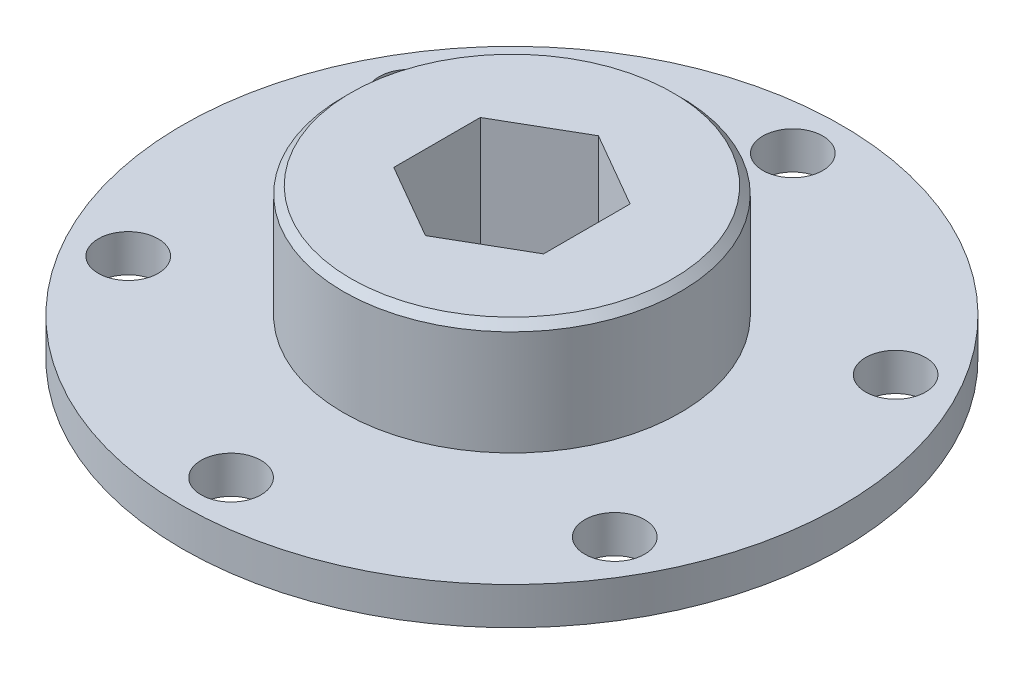
ISO-10303-21;
HEADER;
FILE_DESCRIPTION(('STEP AP214'),'2;1');
FILE_NAME('part.step','',(''),(''),'','','');
FILE_SCHEMA(('AUTOMOTIVE_DESIGN { 1 0 10303 214 1 1 1 1 }'));
ENDSEC;
DATA;
#1=APPLICATION_CONTEXT('core data for automotive mechanical design processes');
#2=APPLICATION_PROTOCOL_DEFINITION('international standard','automotive_design',2000,#1);
#3=PRODUCT_CONTEXT('',#1,'mechanical');
#4=PRODUCT('Part','Part','',(#3));
#5=PRODUCT_RELATED_PRODUCT_CATEGORY('part','',(#4));
#6=PRODUCT_DEFINITION_FORMATION('','',#4);
#7=PRODUCT_DEFINITION_CONTEXT('part definition',#1,'design');
#8=PRODUCT_DEFINITION('design','',#6,#7);
#9=PRODUCT_DEFINITION_SHAPE('','',#8);
#10=(LENGTH_UNIT() NAMED_UNIT(*) SI_UNIT(.MILLI.,.METRE.));
#11=(NAMED_UNIT(*) PLANE_ANGLE_UNIT() SI_UNIT($,.RADIAN.));
#12=(NAMED_UNIT(*) SI_UNIT($,.STERADIAN.) SOLID_ANGLE_UNIT());
#13=UNCERTAINTY_MEASURE_WITH_UNIT(LENGTH_MEASURE(1.E-05),#10,'distance_accuracy_value','');
#14=(GEOMETRIC_REPRESENTATION_CONTEXT(3) GLOBAL_UNCERTAINTY_ASSIGNED_CONTEXT((#13)) GLOBAL_UNIT_ASSIGNED_CONTEXT((#10,
#11,#12)) REPRESENTATION_CONTEXT('',''));
#15=CARTESIAN_POINT('',(0.,0.,0.));
#16=DIRECTION('',(0.,0.,1.));
#17=DIRECTION('',(1.,0.,0.));
#18=AXIS2_PLACEMENT_3D('',#15,#16,#17);
#19=CARTESIAN_POINT('',(0.,3.175,0.));
#20=DIRECTION('',(0.,-1.,0.));
#21=DIRECTION('',(0.,0.,-1.));
#22=AXIS2_PLACEMENT_3D('',#19,#20,#21);
#23=CYLINDRICAL_SURFACE('',#22,27.94);
#24=CARTESIAN_POINT('',(0.,3.175,0.));
#25=DIRECTION('',(0.,1.,0.));
#26=DIRECTION('',(0.,0.,1.));
#27=AXIS2_PLACEMENT_3D('',#24,#25,#26);
#28=CIRCLE('',#27,27.94);
#29=CARTESIAN_POINT('',(0.,3.175,27.94));
#30=VERTEX_POINT('',#29);
#31=EDGE_CURVE('E134',#30,#30,#28,.T.);
#32=ORIENTED_EDGE('',*,*,#31,.F.);
#33=EDGE_LOOP('',(#32));
#34=FACE_BOUND('',#33,.T.);
#35=CARTESIAN_POINT('',(0.,0.,0.));
#36=DIRECTION('',(0.,1.,0.));
#37=DIRECTION('',(0.,0.,1.));
#38=AXIS2_PLACEMENT_3D('',#35,#36,#37);
#39=CIRCLE('',#38,27.94);
#40=CARTESIAN_POINT('',(0.,0.,27.94));
#41=VERTEX_POINT('',#40);
#42=EDGE_CURVE('E119',#41,#41,#39,.T.);
#43=ORIENTED_EDGE('',*,*,#42,.T.);
#44=EDGE_LOOP('',(#43));
#45=FACE_BOUND('',#44,.T.);
#46=ADVANCED_FACE('F32',(#34,#45),#23,.T.);
#47=CARTESIAN_POINT('',(0.,3.175,0.));
#48=DIRECTION('',(0.,1.,0.));
#49=DIRECTION('',(0.,0.,1.));
#50=AXIS2_PLACEMENT_3D('',#47,#48,#49);
#51=PLANE('',#50);
#52=CARTESIAN_POINT('',(0.,3.175,23.8125));
#53=DIRECTION('',(0.,1.,0.));
#54=DIRECTION('',(0.,0.,1.));
#55=AXIS2_PLACEMENT_3D('',#52,#53,#54);
#56=CIRCLE('',#55,2.54);
#57=CARTESIAN_POINT('',(0.,3.175,26.3525));
#58=VERTEX_POINT('',#57);
#59=EDGE_CURVE('E103',#58,#58,#56,.T.);
#60=ORIENTED_EDGE('',*,*,#59,.F.);
#61=EDGE_LOOP('',(#60));
#62=FACE_BOUND('',#61,.T.);
#63=CARTESIAN_POINT('',(-20.6222299276166,3.175,11.9062499999994));
#64=DIRECTION('',(0.,1.,0.));
#65=DIRECTION('',(0.,0.,1.));
#66=AXIS2_PLACEMENT_3D('',#63,#64,#65);
#67=CIRCLE('',#66,2.54);
#68=CARTESIAN_POINT('',(-20.6222299276166,3.175,14.4462499999994));
#69=VERTEX_POINT('',#68);
#70=EDGE_CURVE('E106',#69,#69,#67,.T.);
#71=ORIENTED_EDGE('',*,*,#70,.F.);
#72=EDGE_LOOP('',(#71));
#73=FACE_BOUND('',#72,.T.);
#74=CARTESIAN_POINT('',(-20.6222299276159,3.175,-11.9062500000006));
#75=DIRECTION('',(0.,1.,0.));
#76=DIRECTION('',(0.,0.,1.));
#77=AXIS2_PLACEMENT_3D('',#74,#75,#76);
#78=CIRCLE('',#77,2.54);
#79=CARTESIAN_POINT('',(-20.6222299276159,3.175,-9.36625000000059));
#80=VERTEX_POINT('',#79);
#81=EDGE_CURVE('E368',#80,#80,#78,.T.);
#82=ORIENTED_EDGE('',*,*,#81,.F.);
#83=EDGE_LOOP('',(#82));
#84=FACE_BOUND('',#83,.T.);
#85=CARTESIAN_POINT('',(1.34775153124205E-12,3.175,-23.8125));
#86=DIRECTION('',(0.,1.,0.));
#87=DIRECTION('',(0.,0.,1.));
#88=AXIS2_PLACEMENT_3D('',#85,#86,#87);
#89=CIRCLE('',#88,2.54);
#90=CARTESIAN_POINT('',(1.34775153124205E-12,3.175,-21.2725));
#91=VERTEX_POINT('',#90);
#92=EDGE_CURVE('E365',#91,#91,#89,.T.);
#93=ORIENTED_EDGE('',*,*,#92,.F.);
#94=EDGE_LOOP('',(#93));
#95=FACE_BOUND('',#94,.T.);
#96=CARTESIAN_POINT('',(20.622229927618,3.175,-11.9062499999994));
#97=DIRECTION('',(0.,1.,0.));
#98=DIRECTION('',(0.,0.,1.));
#99=AXIS2_PLACEMENT_3D('',#96,#97,#98);
#100=CIRCLE('',#99,2.54);
#101=CARTESIAN_POINT('',(20.622229927618,3.175,-9.36624999999941));
#102=VERTEX_POINT('',#101);
#103=EDGE_CURVE('E346',#102,#102,#100,.T.);
#104=ORIENTED_EDGE('',*,*,#103,.F.);
#105=EDGE_LOOP('',(#104));
#106=FACE_BOUND('',#105,.T.);
#107=CARTESIAN_POINT('',(20.6222299276173,3.175,11.9062500000006));
#108=DIRECTION('',(0.,1.,0.));
#109=DIRECTION('',(0.,0.,1.));
#110=AXIS2_PLACEMENT_3D('',#107,#108,#109);
#111=CIRCLE('',#110,2.54);
#112=CARTESIAN_POINT('',(20.6222299276173,3.175,14.4462500000006));
#113=VERTEX_POINT('',#112);
#114=EDGE_CURVE('E342',#113,#113,#111,.T.);
#115=ORIENTED_EDGE('',*,*,#114,.F.);
#116=EDGE_LOOP('',(#115));
#117=FACE_BOUND('',#116,.T.);
#118=CARTESIAN_POINT('',(0.,3.175,0.));
#119=DIRECTION('',(0.,1.,0.));
#120=DIRECTION('',(0.,0.,1.));
#121=AXIS2_PLACEMENT_3D('',#118,#119,#120);
#122=CIRCLE('',#121,14.2875);
#123=CARTESIAN_POINT('',(0.,3.175,14.2875));
#124=VERTEX_POINT('',#123);
#125=EDGE_CURVE('E130',#124,#124,#122,.T.);
#126=ORIENTED_EDGE('',*,*,#125,.F.);
#127=EDGE_LOOP('',(#126));
#128=FACE_BOUND('',#127,.T.);
#129=ORIENTED_EDGE('',*,*,#31,.T.);
#130=EDGE_LOOP('',(#129));
#131=FACE_BOUND('',#130,.T.);
#132=ADVANCED_FACE('F176',(#62,#73,#84,#95,#106,#117,#128,#131),#51,.T.);
#133=CARTESIAN_POINT('',(0.,0.,0.));
#134=DIRECTION('',(0.,1.,0.));
#135=DIRECTION('',(0.,0.,1.));
#136=AXIS2_PLACEMENT_3D('',#133,#134,#135);
#137=PLANE('',#136);
#138=CARTESIAN_POINT('',(0.,0.,23.8125));
#139=DIRECTION('',(0.,-1.,0.));
#140=DIRECTION('',(0.,0.,-1.));
#141=AXIS2_PLACEMENT_3D('',#138,#139,#140);
#142=CIRCLE('',#141,2.54);
#143=CARTESIAN_POINT('',(0.,0.,21.2725));
#144=VERTEX_POINT('',#143);
#145=EDGE_CURVE('E341',#144,#144,#142,.T.);
#146=ORIENTED_EDGE('',*,*,#145,.F.);
#147=EDGE_LOOP('',(#146));
#148=FACE_BOUND('',#147,.T.);
#149=CARTESIAN_POINT('',(-20.6222299276166,0.,11.9062499999994));
#150=DIRECTION('',(0.,-1.,0.));
#151=DIRECTION('',(0.,0.,-1.));
#152=AXIS2_PLACEMENT_3D('',#149,#150,#151);
#153=CIRCLE('',#152,2.54);
#154=CARTESIAN_POINT('',(-20.6222299276166,0.,9.3662499999994));
#155=VERTEX_POINT('',#154);
#156=EDGE_CURVE('E352',#155,#155,#153,.T.);
#157=ORIENTED_EDGE('',*,*,#156,.F.);
#158=EDGE_LOOP('',(#157));
#159=FACE_BOUND('',#158,.T.);
#160=CARTESIAN_POINT('',(-20.6222299276159,0.,-11.9062500000006));
#161=DIRECTION('',(0.,-1.,0.));
#162=DIRECTION('',(0.,0.,-1.));
#163=AXIS2_PLACEMENT_3D('',#160,#161,#162);
#164=CIRCLE('',#163,2.54);
#165=CARTESIAN_POINT('',(-20.6222299276159,0.,-14.4462500000006));
#166=VERTEX_POINT('',#165);
#167=EDGE_CURVE('E354',#166,#166,#164,.T.);
#168=ORIENTED_EDGE('',*,*,#167,.F.);
#169=EDGE_LOOP('',(#168));
#170=FACE_BOUND('',#169,.T.);
#171=CARTESIAN_POINT('',(1.34775153124205E-12,0.,-23.8125));
#172=DIRECTION('',(0.,-1.,0.));
#173=DIRECTION('',(0.,0.,-1.));
#174=AXIS2_PLACEMENT_3D('',#171,#172,#173);
#175=CIRCLE('',#174,2.54);
#176=CARTESIAN_POINT('',(1.34775153124205E-12,0.,-26.3525));
#177=VERTEX_POINT('',#176);
#178=EDGE_CURVE('E358',#177,#177,#175,.T.);
#179=ORIENTED_EDGE('',*,*,#178,.F.);
#180=EDGE_LOOP('',(#179));
#181=FACE_BOUND('',#180,.T.);
#182=CARTESIAN_POINT('',(20.622229927618,0.,-11.9062499999994));
#183=DIRECTION('',(0.,-1.,0.));
#184=DIRECTION('',(0.,0.,-1.));
#185=AXIS2_PLACEMENT_3D('',#182,#183,#184);
#186=CIRCLE('',#185,2.54);
#187=CARTESIAN_POINT('',(20.622229927618,0.,-14.4462499999994));
#188=VERTEX_POINT('',#187);
#189=EDGE_CURVE('E349',#188,#188,#186,.T.);
#190=ORIENTED_EDGE('',*,*,#189,.F.);
#191=EDGE_LOOP('',(#190));
#192=FACE_BOUND('',#191,.T.);
#193=CARTESIAN_POINT('',(20.6222299276173,0.,11.9062500000006));
#194=DIRECTION('',(0.,-1.,0.));
#195=DIRECTION('',(0.,0.,-1.));
#196=AXIS2_PLACEMENT_3D('',#193,#194,#195);
#197=CIRCLE('',#196,2.54);
#198=CARTESIAN_POINT('',(20.6222299276173,0.,9.36625000000059));
#199=VERTEX_POINT('',#198);
#200=EDGE_CURVE('E343',#199,#199,#197,.T.);
#201=ORIENTED_EDGE('',*,*,#200,.F.);
#202=EDGE_LOOP('',(#201));
#203=FACE_BOUND('',#202,.T.);
#204=DIRECTION('',(0.866025403784437,0.,-0.500000000000003));
#205=VECTOR('',#204,1.);
#206=CARTESIAN_POINT('',(0.,0.,7.33234841870823));
#207=LINE('',#206,#205);
#208=CARTESIAN_POINT('',(0.,0.,7.33234841870823));
#209=VERTEX_POINT('',#208);
#210=CARTESIAN_POINT('',(6.35,0.,3.66617420935409));
#211=VERTEX_POINT('',#210);
#212=EDGE_CURVE('E92',#209,#211,#207,.T.);
#213=ORIENTED_EDGE('',*,*,#212,.T.);
#214=DIRECTION('',(0.,0.,-1.));
#215=VECTOR('',#214,1.);
#216=CARTESIAN_POINT('',(6.35,0.,3.66617420935409));
#217=LINE('',#216,#215);
#218=CARTESIAN_POINT('',(6.34999999999997,0.,-3.66617420935414));
#219=VERTEX_POINT('',#218);
#220=EDGE_CURVE('E87',#211,#219,#217,.T.);
#221=ORIENTED_EDGE('',*,*,#220,.T.);
#222=DIRECTION('',(-0.86602540378444,0.,-0.499999999999997));
#223=VECTOR('',#222,1.);
#224=CARTESIAN_POINT('',(6.34999999999997,0.,-3.66617420935414));
#225=LINE('',#224,#223);
#226=CARTESIAN_POINT('',(0.,0.,-7.33234841870823));
#227=VERTEX_POINT('',#226);
#228=EDGE_CURVE('E95',#219,#227,#225,.T.);
#229=ORIENTED_EDGE('',*,*,#228,.T.);
#230=DIRECTION('',(-0.866025403784437,0.,0.500000000000003));
#231=VECTOR('',#230,1.);
#232=CARTESIAN_POINT('',(0.,0.,-7.33234841870823));
#233=LINE('',#232,#231);
#234=CARTESIAN_POINT('',(-6.35,0.,-3.66617420935409));
#235=VERTEX_POINT('',#234);
#236=EDGE_CURVE('E47',#227,#235,#233,.T.);
#237=ORIENTED_EDGE('',*,*,#236,.T.);
#238=DIRECTION('',(0.,0.,1.));
#239=VECTOR('',#238,1.);
#240=CARTESIAN_POINT('',(-6.35,0.,-3.66617420935409));
#241=LINE('',#240,#239);
#242=CARTESIAN_POINT('',(-6.34999999999996,0.,3.66617420935414));
#243=VERTEX_POINT('',#242);
#244=EDGE_CURVE('E111',#235,#243,#241,.T.);
#245=ORIENTED_EDGE('',*,*,#244,.T.);
#246=DIRECTION('',(0.866025403784441,0.,0.499999999999996));
#247=VECTOR('',#246,1.);
#248=CARTESIAN_POINT('',(-6.34999999999996,0.,3.66617420935414));
#249=LINE('',#248,#247);
#250=EDGE_CURVE('E114',#243,#209,#249,.T.);
#251=ORIENTED_EDGE('',*,*,#250,.T.);
#252=EDGE_LOOP('',(#213,#221,#229,#237,#245,#251));
#253=FACE_BOUND('',#252,.T.);
#254=ORIENTED_EDGE('',*,*,#42,.F.);
#255=EDGE_LOOP('',(#254));
#256=FACE_BOUND('',#255,.T.);
#257=ADVANCED_FACE('F99',(#148,#159,#170,#181,#192,#203,#253,#256),#137,.F.);
#258=CARTESIAN_POINT('',(0.,12.7,0.));
#259=DIRECTION('',(0.,-1.,0.));
#260=DIRECTION('',(0.,0.,-1.));
#261=AXIS2_PLACEMENT_3D('',#258,#259,#260);
#262=CYLINDRICAL_SURFACE('',#261,14.2875);
#263=CARTESIAN_POINT('',(0.,12.065,0.));
#264=DIRECTION('',(0.,1.,0.));
#265=DIRECTION('',(0.,0.,1.));
#266=AXIS2_PLACEMENT_3D('',#263,#264,#265);
#267=CIRCLE('',#266,14.2875);
#268=CARTESIAN_POINT('',(0.,12.065,14.2875));
#269=VERTEX_POINT('',#268);
#270=EDGE_CURVE('E141',#269,#269,#267,.F.);
#271=ORIENTED_EDGE('',*,*,#270,.T.);
#272=EDGE_LOOP('',(#271));
#273=FACE_BOUND('',#272,.T.);
#274=ORIENTED_EDGE('',*,*,#125,.T.);
#275=EDGE_LOOP('',(#274));
#276=FACE_BOUND('',#275,.T.);
#277=ADVANCED_FACE('F187',(#273,#276),#262,.T.);
#278=CARTESIAN_POINT('',(0.,12.7,0.));
#279=DIRECTION('',(0.,1.,0.));
#280=DIRECTION('',(0.,0.,1.));
#281=AXIS2_PLACEMENT_3D('',#278,#279,#280);
#282=PLANE('',#281);
#283=DIRECTION('',(0.,0.,-1.));
#284=VECTOR('',#283,1.);
#285=CARTESIAN_POINT('',(6.34999999999998,12.7,0.));
#286=LINE('',#285,#284);
#287=CARTESIAN_POINT('',(6.35,12.7,3.66617420935409));
#288=VERTEX_POINT('',#287);
#289=CARTESIAN_POINT('',(6.34999999999997,12.7,-3.66617420935414));
#290=VERTEX_POINT('',#289);
#291=EDGE_CURVE('E11',#288,#290,#286,.T.);
#292=ORIENTED_EDGE('',*,*,#291,.F.);
#293=DIRECTION('',(0.866025403784437,0.,-0.500000000000003));
#294=VECTOR('',#293,1.);
#295=CARTESIAN_POINT('',(3.17500000000001,12.7,5.49926131403116));
#296=LINE('',#295,#294);
#297=CARTESIAN_POINT('',(0.,12.7,7.33234841870823));
#298=VERTEX_POINT('',#297);
#299=EDGE_CURVE('E40',#298,#288,#296,.T.);
#300=ORIENTED_EDGE('',*,*,#299,.F.);
#301=DIRECTION('',(0.866025403784441,0.,0.499999999999996));
#302=VECTOR('',#301,1.);
#303=CARTESIAN_POINT('',(-3.17499999999997,12.7,5.49926131403118));
#304=LINE('',#303,#302);
#305=CARTESIAN_POINT('',(-6.34999999999996,12.7,3.66617420935414));
#306=VERTEX_POINT('',#305);
#307=EDGE_CURVE('E150',#306,#298,#304,.T.);
#308=ORIENTED_EDGE('',*,*,#307,.F.);
#309=DIRECTION('',(0.,0.,1.));
#310=VECTOR('',#309,1.);
#311=CARTESIAN_POINT('',(-6.34999999999998,12.7,0.));
#312=LINE('',#311,#310);
#313=CARTESIAN_POINT('',(-6.35,12.7,-3.66617420935409));
#314=VERTEX_POINT('',#313);
#315=EDGE_CURVE('E148',#314,#306,#312,.T.);
#316=ORIENTED_EDGE('',*,*,#315,.F.);
#317=DIRECTION('',(-0.866025403784437,0.,0.500000000000003));
#318=VECTOR('',#317,1.);
#319=CARTESIAN_POINT('',(-3.17500000000001,12.7,-5.49926131403116));
#320=LINE('',#319,#318);
#321=CARTESIAN_POINT('',(0.,12.7,-7.33234841870823));
#322=VERTEX_POINT('',#321);
#323=EDGE_CURVE('E146',#322,#314,#320,.T.);
#324=ORIENTED_EDGE('',*,*,#323,.F.);
#325=DIRECTION('',(-0.86602540378444,0.,-0.499999999999997));
#326=VECTOR('',#325,1.);
#327=CARTESIAN_POINT('',(3.17499999999997,12.7,-5.49926131403118));
#328=LINE('',#327,#326);
#329=EDGE_CURVE('E144',#290,#322,#328,.T.);
#330=ORIENTED_EDGE('',*,*,#329,.F.);
#331=EDGE_LOOP('',(#292,#300,#308,#316,#324,#330));
#332=FACE_BOUND('',#331,.T.);
#333=CARTESIAN_POINT('',(0.,12.7,0.));
#334=DIRECTION('',(0.,1.,0.));
#335=DIRECTION('',(0.,0.,1.));
#336=AXIS2_PLACEMENT_3D('',#333,#334,#335);
#337=CIRCLE('',#336,13.6525000000001);
#338=CARTESIAN_POINT('',(0.,12.7,13.6525000000001));
#339=VERTEX_POINT('',#338);
#340=EDGE_CURVE('E133',#339,#339,#337,.T.);
#341=ORIENTED_EDGE('',*,*,#340,.T.);
#342=EDGE_LOOP('',(#341));
#343=FACE_BOUND('',#342,.T.);
#344=ADVANCED_FACE('F156',(#332,#343),#282,.T.);
#345=CARTESIAN_POINT('',(0.,12.7,0.));
#346=DIRECTION('',(0.,-1.,0.));
#347=DIRECTION('',(0.,0.,-1.));
#348=AXIS2_PLACEMENT_3D('',#345,#346,#347);
#349=CONICAL_SURFACE('',#348,13.6525000000001,0.785398163397442);
#350=ORIENTED_EDGE('',*,*,#270,.F.);
#351=EDGE_LOOP('',(#350));
#352=FACE_BOUND('',#351,.T.);
#353=ORIENTED_EDGE('',*,*,#340,.F.);
#354=EDGE_LOOP('',(#353));
#355=FACE_BOUND('',#354,.T.);
#356=ADVANCED_FACE('F34',(#352,#355),#349,.T.);
#357=CARTESIAN_POINT('',(6.35,0.,3.66617420935409));
#358=DIRECTION('',(1.,0.,0.));
#359=DIRECTION('',(0.,0.,-1.));
#360=AXIS2_PLACEMENT_3D('',#357,#358,#359);
#361=PLANE('',#360);
#362=ORIENTED_EDGE('',*,*,#291,.T.);
#363=DIRECTION('',(0.,1.,0.));
#364=VECTOR('',#363,1.);
#365=CARTESIAN_POINT('',(6.34999999999997,0.,-3.66617420935414));
#366=LINE('',#365,#364);
#367=EDGE_CURVE('E55',#219,#290,#366,.T.);
#368=ORIENTED_EDGE('',*,*,#367,.F.);
#369=ORIENTED_EDGE('',*,*,#220,.F.);
#370=DIRECTION('',(0.,1.,0.));
#371=VECTOR('',#370,1.);
#372=CARTESIAN_POINT('',(6.35,0.,3.66617420935409));
#373=LINE('',#372,#371);
#374=EDGE_CURVE('E117',#211,#288,#373,.T.);
#375=ORIENTED_EDGE('',*,*,#374,.T.);
#376=EDGE_LOOP('',(#362,#368,#369,#375));
#377=FACE_BOUND('',#376,.T.);
#378=ADVANCED_FACE('F84',(#377),#361,.F.);
#379=CARTESIAN_POINT('',(0.,0.,7.33234841870823));
#380=DIRECTION('',(0.500000000000003,0.,0.866025403784437));
#381=DIRECTION('',(0.866025403784437,0.,-0.500000000000003));
#382=AXIS2_PLACEMENT_3D('',#379,#380,#381);
#383=PLANE('',#382);
#384=ORIENTED_EDGE('',*,*,#299,.T.);
#385=ORIENTED_EDGE('',*,*,#374,.F.);
#386=ORIENTED_EDGE('',*,*,#212,.F.);
#387=DIRECTION('',(0.,1.,0.));
#388=VECTOR('',#387,1.);
#389=CARTESIAN_POINT('',(0.,0.,7.33234841870823));
#390=LINE('',#389,#388);
#391=EDGE_CURVE('E120',#209,#298,#390,.T.);
#392=ORIENTED_EDGE('',*,*,#391,.T.);
#393=EDGE_LOOP('',(#384,#385,#386,#392));
#394=FACE_BOUND('',#393,.T.);
#395=ADVANCED_FACE('F153',(#394),#383,.F.);
#396=CARTESIAN_POINT('',(-6.34999999999996,0.,3.66617420935414));
#397=DIRECTION('',(-0.499999999999996,0.,0.866025403784441));
#398=DIRECTION('',(0.866025403784441,0.,0.499999999999996));
#399=AXIS2_PLACEMENT_3D('',#396,#397,#398);
#400=PLANE('',#399);
#401=ORIENTED_EDGE('',*,*,#307,.T.);
#402=ORIENTED_EDGE('',*,*,#391,.F.);
#403=ORIENTED_EDGE('',*,*,#250,.F.);
#404=DIRECTION('',(0.,1.,0.));
#405=VECTOR('',#404,1.);
#406=CARTESIAN_POINT('',(-6.34999999999996,0.,3.66617420935414));
#407=LINE('',#406,#405);
#408=EDGE_CURVE('E123',#243,#306,#407,.T.);
#409=ORIENTED_EDGE('',*,*,#408,.T.);
#410=EDGE_LOOP('',(#401,#402,#403,#409));
#411=FACE_BOUND('',#410,.T.);
#412=ADVANCED_FACE('F165',(#411),#400,.F.);
#413=CARTESIAN_POINT('',(-6.35,0.,-3.66617420935409));
#414=DIRECTION('',(-1.,0.,0.));
#415=DIRECTION('',(0.,0.,1.));
#416=AXIS2_PLACEMENT_3D('',#413,#414,#415);
#417=PLANE('',#416);
#418=ORIENTED_EDGE('',*,*,#315,.T.);
#419=ORIENTED_EDGE('',*,*,#408,.F.);
#420=ORIENTED_EDGE('',*,*,#244,.F.);
#421=DIRECTION('',(0.,1.,0.));
#422=VECTOR('',#421,1.);
#423=CARTESIAN_POINT('',(-6.35,0.,-3.66617420935409));
#424=LINE('',#423,#422);
#425=EDGE_CURVE('E126',#235,#314,#424,.T.);
#426=ORIENTED_EDGE('',*,*,#425,.T.);
#427=EDGE_LOOP('',(#418,#419,#420,#426));
#428=FACE_BOUND('',#427,.T.);
#429=ADVANCED_FACE('F163',(#428),#417,.F.);
#430=CARTESIAN_POINT('',(0.,0.,-7.33234841870823));
#431=DIRECTION('',(-0.500000000000003,0.,-0.866025403784437));
#432=DIRECTION('',(-0.866025403784437,0.,0.500000000000003));
#433=AXIS2_PLACEMENT_3D('',#430,#431,#432);
#434=PLANE('',#433);
#435=ORIENTED_EDGE('',*,*,#323,.T.);
#436=ORIENTED_EDGE('',*,*,#425,.F.);
#437=ORIENTED_EDGE('',*,*,#236,.F.);
#438=DIRECTION('',(0.,1.,0.));
#439=VECTOR('',#438,1.);
#440=CARTESIAN_POINT('',(0.,0.,-7.33234841870823));
#441=LINE('',#440,#439);
#442=EDGE_CURVE('E91',#227,#322,#441,.T.);
#443=ORIENTED_EDGE('',*,*,#442,.T.);
#444=EDGE_LOOP('',(#435,#436,#437,#443));
#445=FACE_BOUND('',#444,.T.);
#446=ADVANCED_FACE('F160',(#445),#434,.F.);
#447=CARTESIAN_POINT('',(6.34999999999997,0.,-3.66617420935414));
#448=DIRECTION('',(0.499999999999997,0.,-0.86602540378444));
#449=DIRECTION('',(-0.86602540378444,0.,-0.499999999999997));
#450=AXIS2_PLACEMENT_3D('',#447,#448,#449);
#451=PLANE('',#450);
#452=ORIENTED_EDGE('',*,*,#329,.T.);
#453=ORIENTED_EDGE('',*,*,#442,.F.);
#454=ORIENTED_EDGE('',*,*,#228,.F.);
#455=ORIENTED_EDGE('',*,*,#367,.T.);
#456=EDGE_LOOP('',(#452,#453,#454,#455));
#457=FACE_BOUND('',#456,.T.);
#458=ADVANCED_FACE('F96',(#457),#451,.F.);
#459=CARTESIAN_POINT('',(20.6222299276173,12.7,11.9062500000006));
#460=DIRECTION('',(0.,-1.,0.));
#461=DIRECTION('',(0.,0.,-1.));
#462=AXIS2_PLACEMENT_3D('',#459,#460,#461);
#463=CYLINDRICAL_SURFACE('',#462,2.54);
#464=ORIENTED_EDGE('',*,*,#114,.T.);
#465=EDGE_LOOP('',(#464));
#466=FACE_BOUND('',#465,.T.);
#467=ORIENTED_EDGE('',*,*,#200,.T.);
#468=EDGE_LOOP('',(#467));
#469=FACE_BOUND('',#468,.T.);
#470=ADVANCED_FACE('F199',(#466,#469),#463,.F.);
#471=CARTESIAN_POINT('',(20.622229927618,12.7,-11.9062499999994));
#472=DIRECTION('',(0.,-1.,0.));
#473=DIRECTION('',(0.,0.,-1.));
#474=AXIS2_PLACEMENT_3D('',#471,#472,#473);
#475=CYLINDRICAL_SURFACE('',#474,2.54);
#476=ORIENTED_EDGE('',*,*,#103,.T.);
#477=EDGE_LOOP('',(#476));
#478=FACE_BOUND('',#477,.T.);
#479=ORIENTED_EDGE('',*,*,#189,.T.);
#480=EDGE_LOOP('',(#479));
#481=FACE_BOUND('',#480,.T.);
#482=ADVANCED_FACE('F216',(#478,#481),#475,.F.);
#483=CARTESIAN_POINT('',(1.34775153124205E-12,12.7,-23.8125));
#484=DIRECTION('',(0.,-1.,0.));
#485=DIRECTION('',(0.,0.,-1.));
#486=AXIS2_PLACEMENT_3D('',#483,#484,#485);
#487=CYLINDRICAL_SURFACE('',#486,2.54);
#488=ORIENTED_EDGE('',*,*,#92,.T.);
#489=EDGE_LOOP('',(#488));
#490=FACE_BOUND('',#489,.T.);
#491=ORIENTED_EDGE('',*,*,#178,.T.);
#492=EDGE_LOOP('',(#491));
#493=FACE_BOUND('',#492,.T.);
#494=ADVANCED_FACE('F225',(#490,#493),#487,.F.);
#495=CARTESIAN_POINT('',(-20.6222299276159,12.7,-11.9062500000006));
#496=DIRECTION('',(0.,-1.,0.));
#497=DIRECTION('',(0.,0.,-1.));
#498=AXIS2_PLACEMENT_3D('',#495,#496,#497);
#499=CYLINDRICAL_SURFACE('',#498,2.54);
#500=ORIENTED_EDGE('',*,*,#81,.T.);
#501=EDGE_LOOP('',(#500));
#502=FACE_BOUND('',#501,.T.);
#503=ORIENTED_EDGE('',*,*,#167,.T.);
#504=EDGE_LOOP('',(#503));
#505=FACE_BOUND('',#504,.T.);
#506=ADVANCED_FACE('F233',(#502,#505),#499,.F.);
#507=CARTESIAN_POINT('',(-20.6222299276166,12.7,11.9062499999994));
#508=DIRECTION('',(0.,-1.,0.));
#509=DIRECTION('',(0.,0.,-1.));
#510=AXIS2_PLACEMENT_3D('',#507,#508,#509);
#511=CYLINDRICAL_SURFACE('',#510,2.54);
#512=ORIENTED_EDGE('',*,*,#70,.T.);
#513=EDGE_LOOP('',(#512));
#514=FACE_BOUND('',#513,.T.);
#515=ORIENTED_EDGE('',*,*,#156,.T.);
#516=EDGE_LOOP('',(#515));
#517=FACE_BOUND('',#516,.T.);
#518=ADVANCED_FACE('F241',(#514,#517),#511,.F.);
#519=CARTESIAN_POINT('',(0.,12.7,23.8125));
#520=DIRECTION('',(0.,-1.,0.));
#521=DIRECTION('',(0.,0.,-1.));
#522=AXIS2_PLACEMENT_3D('',#519,#520,#521);
#523=CYLINDRICAL_SURFACE('',#522,2.54);
#524=ORIENTED_EDGE('',*,*,#59,.T.);
#525=EDGE_LOOP('',(#524));
#526=FACE_BOUND('',#525,.T.);
#527=ORIENTED_EDGE('',*,*,#145,.T.);
#528=EDGE_LOOP('',(#527));
#529=FACE_BOUND('',#528,.T.);
#530=ADVANCED_FACE('F249',(#526,#529),#523,.F.);
#531=CLOSED_SHELL('',(#46,#132,#257,#277,#344,#356,#378,#395,#412,#429,#446,#458,#470,#482,#494,
#506,#518,#530));
#532=MANIFOLD_SOLID_BREP('B2',#531);
#533=ADVANCED_BREP_SHAPE_REPRESENTATION('',(#18,#532),#14);
#534=SHAPE_DEFINITION_REPRESENTATION(#9,#533);
ENDSEC;
END-ISO-10303-21;
